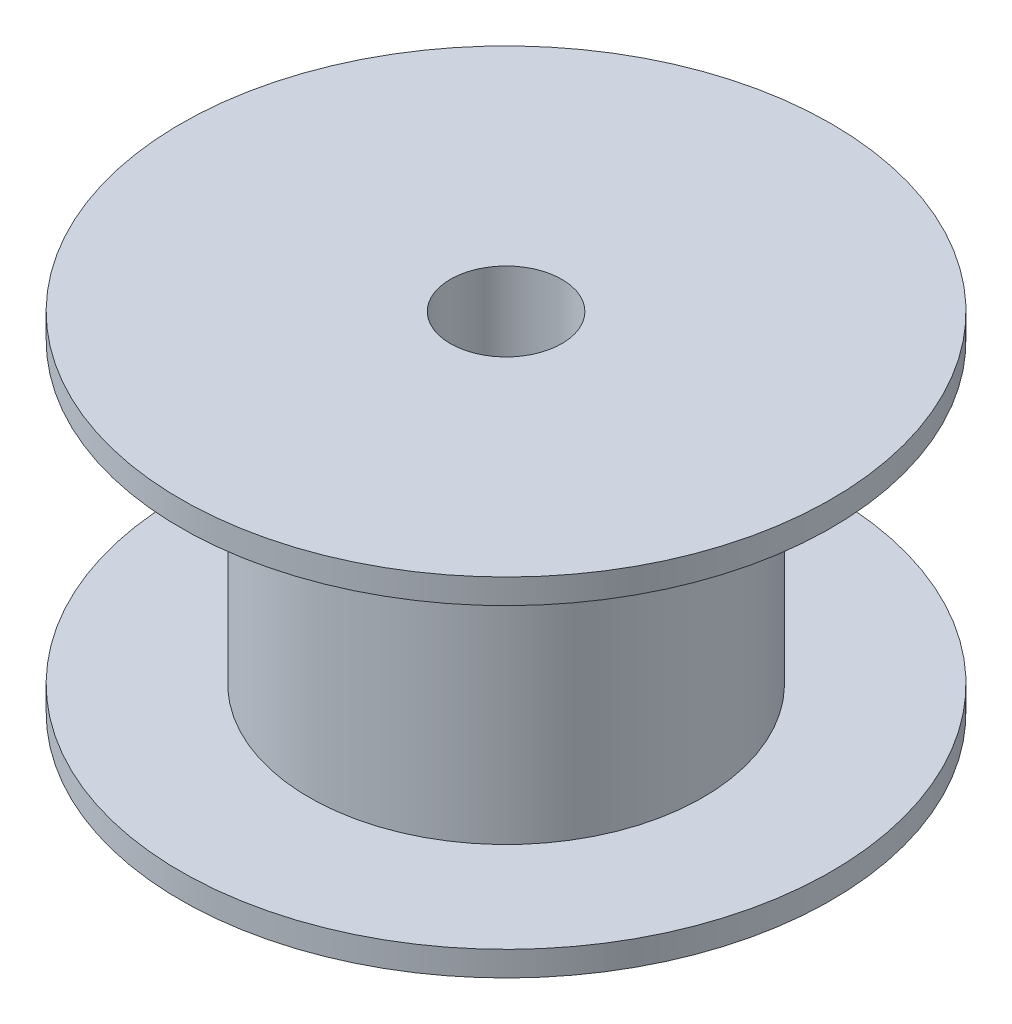
ISO-10303-21;
HEADER;
FILE_DESCRIPTION(('STEP AP214'),'2;1');
FILE_NAME('part.step','',(''),(''),'','','');
FILE_SCHEMA(('AUTOMOTIVE_DESIGN { 1 0 10303 214 1 1 1 1 }'));
ENDSEC;
DATA;
#1=APPLICATION_CONTEXT('core data for automotive mechanical design processes');
#2=APPLICATION_PROTOCOL_DEFINITION('international standard','automotive_design',2000,#1);
#3=PRODUCT_CONTEXT('',#1,'mechanical');
#4=PRODUCT('Part','Part','',(#3));
#5=PRODUCT_RELATED_PRODUCT_CATEGORY('part','',(#4));
#6=PRODUCT_DEFINITION_FORMATION('','',#4);
#7=PRODUCT_DEFINITION_CONTEXT('part definition',#1,'design');
#8=PRODUCT_DEFINITION('design','',#6,#7);
#9=PRODUCT_DEFINITION_SHAPE('','',#8);
#10=(LENGTH_UNIT() NAMED_UNIT(*) SI_UNIT(.MILLI.,.METRE.));
#11=(NAMED_UNIT(*) PLANE_ANGLE_UNIT() SI_UNIT($,.RADIAN.));
#12=(NAMED_UNIT(*) SI_UNIT($,.STERADIAN.) SOLID_ANGLE_UNIT());
#13=UNCERTAINTY_MEASURE_WITH_UNIT(LENGTH_MEASURE(1.E-05),#10,'distance_accuracy_value','');
#14=(GEOMETRIC_REPRESENTATION_CONTEXT(3) GLOBAL_UNCERTAINTY_ASSIGNED_CONTEXT((#13)) GLOBAL_UNIT_ASSIGNED_CONTEXT((#10,
#11,#12)) REPRESENTATION_CONTEXT('',''));
#15=CARTESIAN_POINT('',(0.,0.,0.));
#16=DIRECTION('',(0.,0.,1.));
#17=DIRECTION('',(1.,0.,0.));
#18=AXIS2_PLACEMENT_3D('',#15,#16,#17);
#19=CARTESIAN_POINT('',(0.,-7.,13.112500064));
#20=DIRECTION('',(0.,1.,0.));
#21=DIRECTION('',(0.,0.,1.));
#22=AXIS2_PLACEMENT_3D('',#19,#20,#21);
#23=PLANE('',#22);
#24=CARTESIAN_POINT('',(0.,-7.,0.));
#25=DIRECTION('',(0.,1.,0.));
#26=DIRECTION('',(0.,0.,1.));
#27=AXIS2_PLACEMENT_3D('',#24,#25,#26);
#28=CIRCLE('',#27,2.2479);
#29=CARTESIAN_POINT('',(0.,-7.,2.2479));
#30=VERTEX_POINT('',#29);
#31=EDGE_CURVE('E55',#30,#30,#28,.T.);
#32=ORIENTED_EDGE('',*,*,#31,.T.);
#33=EDGE_LOOP('',(#32));
#34=FACE_BOUND('',#33,.T.);
#35=CARTESIAN_POINT('',(0.,-7.,0.));
#36=DIRECTION('',(0.,-1.,0.));
#37=DIRECTION('',(0.,0.,-1.));
#38=AXIS2_PLACEMENT_3D('',#35,#36,#37);
#39=CIRCLE('',#38,13.112500064);
#40=CARTESIAN_POINT('',(0.,-7.,-13.112500064));
#41=VERTEX_POINT('',#40);
#42=EDGE_CURVE('E52',#41,#41,#39,.T.);
#43=ORIENTED_EDGE('',*,*,#42,.T.);
#44=EDGE_LOOP('',(#43));
#45=FACE_BOUND('',#44,.T.);
#46=ADVANCED_FACE('F30',(#34,#45),#23,.F.);
#47=CARTESIAN_POINT('',(0.,7.,0.));
#48=DIRECTION('',(0.,-1.,0.));
#49=DIRECTION('',(0.,0.,-1.));
#50=AXIS2_PLACEMENT_3D('',#47,#48,#49);
#51=PLANE('',#50);
#52=CARTESIAN_POINT('',(0.,7.,0.));
#53=DIRECTION('',(0.,1.,0.));
#54=DIRECTION('',(0.,0.,1.));
#55=AXIS2_PLACEMENT_3D('',#52,#53,#54);
#56=CIRCLE('',#55,2.2479);
#57=CARTESIAN_POINT('',(0.,7.,2.2479));
#58=VERTEX_POINT('',#57);
#59=EDGE_CURVE('E58',#58,#58,#56,.T.);
#60=ORIENTED_EDGE('',*,*,#59,.F.);
#61=EDGE_LOOP('',(#60));
#62=FACE_BOUND('',#61,.T.);
#63=CARTESIAN_POINT('',(0.,7.,0.));
#64=DIRECTION('',(0.,-1.,0.));
#65=DIRECTION('',(0.,0.,-1.));
#66=AXIS2_PLACEMENT_3D('',#63,#64,#65);
#67=CIRCLE('',#66,13.112500064);
#68=CARTESIAN_POINT('',(0.,7.,-13.112500064));
#69=VERTEX_POINT('',#68);
#70=EDGE_CURVE('E10',#69,#69,#67,.T.);
#71=ORIENTED_EDGE('',*,*,#70,.F.);
#72=EDGE_LOOP('',(#71));
#73=FACE_BOUND('',#72,.T.);
#74=ADVANCED_FACE('F64',(#62,#73),#51,.F.);
#75=CARTESIAN_POINT('',(0.,-7.,0.));
#76=DIRECTION('',(0.,-1.,0.));
#77=DIRECTION('',(0.,0.,-1.));
#78=AXIS2_PLACEMENT_3D('',#75,#76,#77);
#79=CYLINDRICAL_SURFACE('',#78,13.112500064);
#80=CARTESIAN_POINT('',(0.,6.,0.));
#81=DIRECTION('',(0.,-1.,0.));
#82=DIRECTION('',(0.,0.,-1.));
#83=AXIS2_PLACEMENT_3D('',#80,#81,#82);
#84=CIRCLE('',#83,13.112500064);
#85=CARTESIAN_POINT('',(0.,6.,-13.112500064));
#86=VERTEX_POINT('',#85);
#87=EDGE_CURVE('E36',#86,#86,#84,.T.);
#88=ORIENTED_EDGE('',*,*,#87,.F.);
#89=EDGE_LOOP('',(#88));
#90=FACE_BOUND('',#89,.T.);
#91=ORIENTED_EDGE('',*,*,#70,.T.);
#92=EDGE_LOOP('',(#91));
#93=FACE_BOUND('',#92,.T.);
#94=ADVANCED_FACE('F67',(#90,#93),#79,.T.);
#95=CARTESIAN_POINT('',(0.,6.,13.112500064));
#96=DIRECTION('',(0.,1.,0.));
#97=DIRECTION('',(0.,0.,1.));
#98=AXIS2_PLACEMENT_3D('',#95,#96,#97);
#99=PLANE('',#98);
#100=CARTESIAN_POINT('',(0.,6.,0.));
#101=DIRECTION('',(0.,-1.,0.));
#102=DIRECTION('',(0.,0.,-1.));
#103=AXIS2_PLACEMENT_3D('',#100,#101,#102);
#104=CIRCLE('',#103,7.9375);
#105=CARTESIAN_POINT('',(0.,6.,-7.9375));
#106=VERTEX_POINT('',#105);
#107=EDGE_CURVE('E40',#106,#106,#104,.T.);
#108=ORIENTED_EDGE('',*,*,#107,.F.);
#109=EDGE_LOOP('',(#108));
#110=FACE_BOUND('',#109,.T.);
#111=ORIENTED_EDGE('',*,*,#87,.T.);
#112=EDGE_LOOP('',(#111));
#113=FACE_BOUND('',#112,.T.);
#114=ADVANCED_FACE('F72',(#110,#113),#99,.F.);
#115=CARTESIAN_POINT('',(0.,-7.,0.));
#116=DIRECTION('',(0.,-1.,0.));
#117=DIRECTION('',(0.,0.,-1.));
#118=AXIS2_PLACEMENT_3D('',#115,#116,#117);
#119=CYLINDRICAL_SURFACE('',#118,7.9375);
#120=CARTESIAN_POINT('',(0.,-6.,0.));
#121=DIRECTION('',(0.,-1.,0.));
#122=DIRECTION('',(0.,0.,-1.));
#123=AXIS2_PLACEMENT_3D('',#120,#121,#122);
#124=CIRCLE('',#123,7.9375);
#125=CARTESIAN_POINT('',(0.,-6.,-7.9375));
#126=VERTEX_POINT('',#125);
#127=EDGE_CURVE('E44',#126,#126,#124,.T.);
#128=ORIENTED_EDGE('',*,*,#127,.F.);
#129=EDGE_LOOP('',(#128));
#130=FACE_BOUND('',#129,.T.);
#131=ORIENTED_EDGE('',*,*,#107,.T.);
#132=EDGE_LOOP('',(#131));
#133=FACE_BOUND('',#132,.T.);
#134=ADVANCED_FACE('F79',(#130,#133),#119,.T.);
#135=CARTESIAN_POINT('',(0.,-6.,7.9375));
#136=DIRECTION('',(0.,-1.,0.));
#137=DIRECTION('',(0.,0.,-1.));
#138=AXIS2_PLACEMENT_3D('',#135,#136,#137);
#139=PLANE('',#138);
#140=CARTESIAN_POINT('',(0.,-6.,0.));
#141=DIRECTION('',(0.,-1.,0.));
#142=DIRECTION('',(0.,0.,-1.));
#143=AXIS2_PLACEMENT_3D('',#140,#141,#142);
#144=CIRCLE('',#143,13.112500064);
#145=CARTESIAN_POINT('',(0.,-6.,-13.112500064));
#146=VERTEX_POINT('',#145);
#147=EDGE_CURVE('E49',#146,#146,#144,.T.);
#148=ORIENTED_EDGE('',*,*,#147,.F.);
#149=EDGE_LOOP('',(#148));
#150=FACE_BOUND('',#149,.T.);
#151=ORIENTED_EDGE('',*,*,#127,.T.);
#152=EDGE_LOOP('',(#151));
#153=FACE_BOUND('',#152,.T.);
#154=ADVANCED_FACE('F83',(#150,#153),#139,.F.);
#155=CARTESIAN_POINT('',(0.,-7.,0.));
#156=DIRECTION('',(0.,-1.,0.));
#157=DIRECTION('',(0.,0.,-1.));
#158=AXIS2_PLACEMENT_3D('',#155,#156,#157);
#159=CYLINDRICAL_SURFACE('',#158,13.112500064);
#160=ORIENTED_EDGE('',*,*,#42,.F.);
#161=EDGE_LOOP('',(#160));
#162=FACE_BOUND('',#161,.T.);
#163=ORIENTED_EDGE('',*,*,#147,.T.);
#164=EDGE_LOOP('',(#163));
#165=FACE_BOUND('',#164,.T.);
#166=ADVANCED_FACE('F87',(#162,#165),#159,.T.);
#167=CARTESIAN_POINT('',(0.,7.,0.));
#168=DIRECTION('',(0.,1.,0.));
#169=DIRECTION('',(0.,0.,1.));
#170=AXIS2_PLACEMENT_3D('',#167,#168,#169);
#171=CYLINDRICAL_SURFACE('',#170,2.2479);
#172=ORIENTED_EDGE('',*,*,#31,.F.);
#173=EDGE_LOOP('',(#172));
#174=FACE_BOUND('',#173,.T.);
#175=ORIENTED_EDGE('',*,*,#59,.T.);
#176=EDGE_LOOP('',(#175));
#177=FACE_BOUND('',#176,.T.);
#178=ADVANCED_FACE('F62',(#174,#177),#171,.F.);
#179=CLOSED_SHELL('',(#46,#74,#94,#114,#134,#154,#166,#178));
#180=MANIFOLD_SOLID_BREP('B2',#179);
#181=ADVANCED_BREP_SHAPE_REPRESENTATION('',(#18,#180),#14);
#182=SHAPE_DEFINITION_REPRESENTATION(#9,#181);
ENDSEC;
END-ISO-10303-21;
